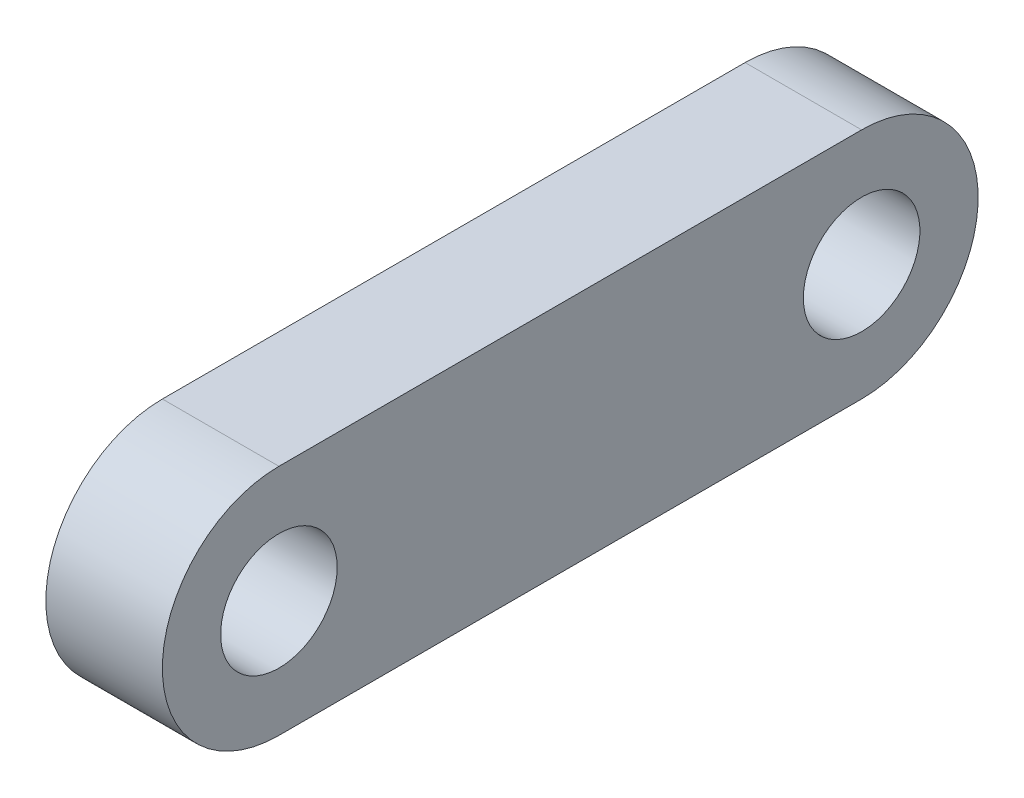
ISO-10303-21;
HEADER;
FILE_DESCRIPTION(('STEP AP214'),'2;1');
FILE_NAME('part.step','',(''),(''),'','','');
FILE_SCHEMA(('AUTOMOTIVE_DESIGN { 1 0 10303 214 1 1 1 1 }'));
ENDSEC;
DATA;
#1=APPLICATION_CONTEXT('core data for automotive mechanical design processes');
#2=APPLICATION_PROTOCOL_DEFINITION('international standard','automotive_design',2000,#1);
#3=PRODUCT_CONTEXT('',#1,'mechanical');
#4=PRODUCT('Part','Part','',(#3));
#5=PRODUCT_RELATED_PRODUCT_CATEGORY('part','',(#4));
#6=PRODUCT_DEFINITION_FORMATION('','',#4);
#7=PRODUCT_DEFINITION_CONTEXT('part definition',#1,'design');
#8=PRODUCT_DEFINITION('design','',#6,#7);
#9=PRODUCT_DEFINITION_SHAPE('','',#8);
#10=(LENGTH_UNIT() NAMED_UNIT(*) SI_UNIT(.MILLI.,.METRE.));
#11=(NAMED_UNIT(*) PLANE_ANGLE_UNIT() SI_UNIT($,.RADIAN.));
#12=(NAMED_UNIT(*) SI_UNIT($,.STERADIAN.) SOLID_ANGLE_UNIT());
#13=UNCERTAINTY_MEASURE_WITH_UNIT(LENGTH_MEASURE(1.E-05),#10,'distance_accuracy_value','');
#14=(GEOMETRIC_REPRESENTATION_CONTEXT(3) GLOBAL_UNCERTAINTY_ASSIGNED_CONTEXT((#13)) GLOBAL_UNIT_ASSIGNED_CONTEXT((#10,
#11,#12)) REPRESENTATION_CONTEXT('',''));
#15=CARTESIAN_POINT('',(0.,0.,0.));
#16=DIRECTION('',(0.,0.,1.));
#17=DIRECTION('',(1.,0.,0.));
#18=AXIS2_PLACEMENT_3D('',#15,#16,#17);
#19=CARTESIAN_POINT('',(8.,0.,20.));
#20=DIRECTION('',(1.,0.,0.));
#21=DIRECTION('',(0.,0.,-1.));
#22=AXIS2_PLACEMENT_3D('',#19,#20,#21);
#23=PLANE('',#22);
#24=CARTESIAN_POINT('',(8.,0.,20.));
#25=DIRECTION('',(1.,0.,0.));
#26=DIRECTION('',(0.,0.,-1.));
#27=AXIS2_PLACEMENT_3D('',#24,#25,#26);
#28=CIRCLE('',#27,4.);
#29=CARTESIAN_POINT('',(8.,0.,16.));
#30=VERTEX_POINT('',#29);
#31=EDGE_CURVE('E102',#30,#30,#28,.T.);
#32=ORIENTED_EDGE('',*,*,#31,.F.);
#33=EDGE_LOOP('',(#32));
#34=FACE_BOUND('',#33,.T.);
#35=CARTESIAN_POINT('',(8.,0.,20.));
#36=DIRECTION('',(1.,0.,0.));
#37=DIRECTION('',(0.,0.,-1.));
#38=AXIS2_PLACEMENT_3D('',#35,#36,#37);
#39=CIRCLE('',#38,7.99999999999999);
#40=CARTESIAN_POINT('',(8.,7.99999999999999,20.));
#41=VERTEX_POINT('',#40);
#42=CARTESIAN_POINT('',(8.,-7.99999999999999,20.));
#43=VERTEX_POINT('',#42);
#44=EDGE_CURVE('E87',#41,#43,#39,.T.);
#45=ORIENTED_EDGE('',*,*,#44,.T.);
#46=DIRECTION('',(0.,0.,-1.));
#47=VECTOR('',#46,1.);
#48=CARTESIAN_POINT('',(8.,-7.99999999999999,20.));
#49=LINE('',#48,#47);
#50=CARTESIAN_POINT('',(8.,-7.99999999999999,-20.));
#51=VERTEX_POINT('',#50);
#52=EDGE_CURVE('E82',#43,#51,#49,.T.);
#53=ORIENTED_EDGE('',*,*,#52,.T.);
#54=CARTESIAN_POINT('',(8.,0.,-20.));
#55=DIRECTION('',(1.,0.,0.));
#56=DIRECTION('',(0.,0.,1.));
#57=AXIS2_PLACEMENT_3D('',#54,#55,#56);
#58=CIRCLE('',#57,8.);
#59=CARTESIAN_POINT('',(8.,8.,-20.));
#60=VERTEX_POINT('',#59);
#61=EDGE_CURVE('E85',#51,#60,#58,.T.);
#62=ORIENTED_EDGE('',*,*,#61,.T.);
#63=DIRECTION('',(0.,0.,1.));
#64=VECTOR('',#63,1.);
#65=CARTESIAN_POINT('',(8.,8.,-20.));
#66=LINE('',#65,#64);
#67=EDGE_CURVE('E52',#60,#41,#66,.T.);
#68=ORIENTED_EDGE('',*,*,#67,.T.);
#69=EDGE_LOOP('',(#45,#53,#62,#68));
#70=FACE_BOUND('',#69,.T.);
#71=CARTESIAN_POINT('',(8.,0.,-20.));
#72=DIRECTION('',(1.,0.,0.));
#73=DIRECTION('',(0.,0.,1.));
#74=AXIS2_PLACEMENT_3D('',#71,#72,#73);
#75=CIRCLE('',#74,4.);
#76=CARTESIAN_POINT('',(8.,0.,-16.));
#77=VERTEX_POINT('',#76);
#78=EDGE_CURVE('E117',#77,#77,#75,.T.);
#79=ORIENTED_EDGE('',*,*,#78,.F.);
#80=EDGE_LOOP('',(#79));
#81=FACE_BOUND('',#80,.T.);
#82=ADVANCED_FACE('F35',(#34,#70,#81),#23,.T.);
#83=CARTESIAN_POINT('',(0.,0.,20.));
#84=DIRECTION('',(1.,0.,0.));
#85=DIRECTION('',(0.,0.,-1.));
#86=AXIS2_PLACEMENT_3D('',#83,#84,#85);
#87=PLANE('',#86);
#88=CARTESIAN_POINT('',(0.,0.,20.));
#89=DIRECTION('',(1.,0.,0.));
#90=DIRECTION('',(0.,0.,-1.));
#91=AXIS2_PLACEMENT_3D('',#88,#89,#90);
#92=CIRCLE('',#91,4.);
#93=CARTESIAN_POINT('',(0.,0.,16.));
#94=VERTEX_POINT('',#93);
#95=EDGE_CURVE('E114',#94,#94,#92,.T.);
#96=ORIENTED_EDGE('',*,*,#95,.T.);
#97=EDGE_LOOP('',(#96));
#98=FACE_BOUND('',#97,.T.);
#99=CARTESIAN_POINT('',(0.,0.,20.));
#100=DIRECTION('',(1.,0.,0.));
#101=DIRECTION('',(0.,0.,-1.));
#102=AXIS2_PLACEMENT_3D('',#99,#100,#101);
#103=CIRCLE('',#102,7.99999999999999);
#104=CARTESIAN_POINT('',(0.,7.99999999999999,20.));
#105=VERTEX_POINT('',#104);
#106=CARTESIAN_POINT('',(0.,-7.99999999999999,20.));
#107=VERTEX_POINT('',#106);
#108=EDGE_CURVE('E99',#105,#107,#103,.T.);
#109=ORIENTED_EDGE('',*,*,#108,.F.);
#110=DIRECTION('',(0.,0.,1.));
#111=VECTOR('',#110,1.);
#112=CARTESIAN_POINT('',(0.,8.,-20.));
#113=LINE('',#112,#111);
#114=CARTESIAN_POINT('',(0.,8.,-20.));
#115=VERTEX_POINT('',#114);
#116=EDGE_CURVE('E75',#115,#105,#113,.T.);
#117=ORIENTED_EDGE('',*,*,#116,.F.);
#118=CARTESIAN_POINT('',(0.,0.,-20.));
#119=DIRECTION('',(1.,0.,0.));
#120=DIRECTION('',(0.,0.,1.));
#121=AXIS2_PLACEMENT_3D('',#118,#119,#120);
#122=CIRCLE('',#121,8.);
#123=CARTESIAN_POINT('',(0.,-7.99999999999999,-20.));
#124=VERTEX_POINT('',#123);
#125=EDGE_CURVE('E69',#124,#115,#122,.T.);
#126=ORIENTED_EDGE('',*,*,#125,.F.);
#127=DIRECTION('',(0.,0.,-1.));
#128=VECTOR('',#127,1.);
#129=CARTESIAN_POINT('',(0.,-7.99999999999999,20.));
#130=LINE('',#129,#128);
#131=EDGE_CURVE('E91',#107,#124,#130,.T.);
#132=ORIENTED_EDGE('',*,*,#131,.F.);
#133=EDGE_LOOP('',(#109,#117,#126,#132));
#134=FACE_BOUND('',#133,.T.);
#135=CARTESIAN_POINT('',(0.,0.,-20.));
#136=DIRECTION('',(1.,0.,0.));
#137=DIRECTION('',(0.,0.,1.));
#138=AXIS2_PLACEMENT_3D('',#135,#136,#137);
#139=CIRCLE('',#138,4.);
#140=CARTESIAN_POINT('',(0.,0.,-16.));
#141=VERTEX_POINT('',#140);
#142=EDGE_CURVE('E120',#141,#141,#139,.T.);
#143=ORIENTED_EDGE('',*,*,#142,.T.);
#144=EDGE_LOOP('',(#143));
#145=FACE_BOUND('',#144,.T.);
#146=ADVANCED_FACE('F110',(#98,#134,#145),#87,.F.);
#147=CARTESIAN_POINT('',(8.,0.,20.));
#148=DIRECTION('',(-1.,0.,0.));
#149=DIRECTION('',(0.,0.,1.));
#150=AXIS2_PLACEMENT_3D('',#147,#148,#149);
#151=CYLINDRICAL_SURFACE('',#150,7.99999999999999);
#152=ORIENTED_EDGE('',*,*,#108,.T.);
#153=DIRECTION('',(-1.,0.,0.));
#154=VECTOR('',#153,1.);
#155=CARTESIAN_POINT('',(8.,-7.99999999999999,20.));
#156=LINE('',#155,#154);
#157=EDGE_CURVE('E11',#43,#107,#156,.T.);
#158=ORIENTED_EDGE('',*,*,#157,.F.);
#159=ORIENTED_EDGE('',*,*,#44,.F.);
#160=DIRECTION('',(-1.,0.,0.));
#161=VECTOR('',#160,1.);
#162=CARTESIAN_POINT('',(8.,7.99999999999999,20.));
#163=LINE('',#162,#161);
#164=EDGE_CURVE('E95',#41,#105,#163,.T.);
#165=ORIENTED_EDGE('',*,*,#164,.T.);
#166=EDGE_LOOP('',(#152,#158,#159,#165));
#167=FACE_BOUND('',#166,.T.);
#168=ADVANCED_FACE('F37',(#167),#151,.T.);
#169=CARTESIAN_POINT('',(8.,-7.99999999999999,20.));
#170=DIRECTION('',(0.,1.,0.));
#171=DIRECTION('',(0.,0.,1.));
#172=AXIS2_PLACEMENT_3D('',#169,#170,#171);
#173=PLANE('',#172);
#174=ORIENTED_EDGE('',*,*,#131,.T.);
#175=DIRECTION('',(-1.,0.,0.));
#176=VECTOR('',#175,1.);
#177=CARTESIAN_POINT('',(8.,-7.99999999999999,-20.));
#178=LINE('',#177,#176);
#179=EDGE_CURVE('E44',#51,#124,#178,.T.);
#180=ORIENTED_EDGE('',*,*,#179,.F.);
#181=ORIENTED_EDGE('',*,*,#52,.F.);
#182=ORIENTED_EDGE('',*,*,#157,.T.);
#183=EDGE_LOOP('',(#174,#180,#181,#182));
#184=FACE_BOUND('',#183,.T.);
#185=ADVANCED_FACE('F90',(#184),#173,.F.);
#186=CARTESIAN_POINT('',(8.,0.,-20.));
#187=DIRECTION('',(-1.,0.,0.));
#188=DIRECTION('',(0.,0.,1.));
#189=AXIS2_PLACEMENT_3D('',#186,#187,#188);
#190=CYLINDRICAL_SURFACE('',#189,8.);
#191=ORIENTED_EDGE('',*,*,#125,.T.);
#192=DIRECTION('',(-1.,0.,0.));
#193=VECTOR('',#192,1.);
#194=CARTESIAN_POINT('',(8.,8.,-20.));
#195=LINE('',#194,#193);
#196=EDGE_CURVE('E92',#60,#115,#195,.T.);
#197=ORIENTED_EDGE('',*,*,#196,.F.);
#198=ORIENTED_EDGE('',*,*,#61,.F.);
#199=ORIENTED_EDGE('',*,*,#179,.T.);
#200=EDGE_LOOP('',(#191,#197,#198,#199));
#201=FACE_BOUND('',#200,.T.);
#202=ADVANCED_FACE('F93',(#201),#190,.T.);
#203=CARTESIAN_POINT('',(8.,8.,-20.));
#204=DIRECTION('',(0.,-1.,0.));
#205=DIRECTION('',(0.,0.,-1.));
#206=AXIS2_PLACEMENT_3D('',#203,#204,#205);
#207=PLANE('',#206);
#208=ORIENTED_EDGE('',*,*,#116,.T.);
#209=ORIENTED_EDGE('',*,*,#164,.F.);
#210=ORIENTED_EDGE('',*,*,#67,.F.);
#211=ORIENTED_EDGE('',*,*,#196,.T.);
#212=EDGE_LOOP('',(#208,#209,#210,#211));
#213=FACE_BOUND('',#212,.T.);
#214=ADVANCED_FACE('F107',(#213),#207,.F.);
#215=CARTESIAN_POINT('',(8.,0.,20.));
#216=DIRECTION('',(-1.,0.,0.));
#217=DIRECTION('',(0.,0.,1.));
#218=AXIS2_PLACEMENT_3D('',#215,#216,#217);
#219=CYLINDRICAL_SURFACE('',#218,4.);
#220=ORIENTED_EDGE('',*,*,#31,.T.);
#221=EDGE_LOOP('',(#220));
#222=FACE_BOUND('',#221,.T.);
#223=ORIENTED_EDGE('',*,*,#95,.F.);
#224=EDGE_LOOP('',(#223));
#225=FACE_BOUND('',#224,.T.);
#226=ADVANCED_FACE('F138',(#222,#225),#219,.F.);
#227=CARTESIAN_POINT('',(8.,0.,-20.));
#228=DIRECTION('',(-1.,0.,0.));
#229=DIRECTION('',(0.,0.,1.));
#230=AXIS2_PLACEMENT_3D('',#227,#228,#229);
#231=CYLINDRICAL_SURFACE('',#230,4.);
#232=ORIENTED_EDGE('',*,*,#78,.T.);
#233=EDGE_LOOP('',(#232));
#234=FACE_BOUND('',#233,.T.);
#235=ORIENTED_EDGE('',*,*,#142,.F.);
#236=EDGE_LOOP('',(#235));
#237=FACE_BOUND('',#236,.T.);
#238=ADVANCED_FACE('F126',(#234,#237),#231,.F.);
#239=CLOSED_SHELL('',(#82,#146,#168,#185,#202,#214,#226,#238));
#240=MANIFOLD_SOLID_BREP('B2',#239);
#241=ADVANCED_BREP_SHAPE_REPRESENTATION('',(#18,#240),#14);
#242=SHAPE_DEFINITION_REPRESENTATION(#9,#241);
ENDSEC;
END-ISO-10303-21;
